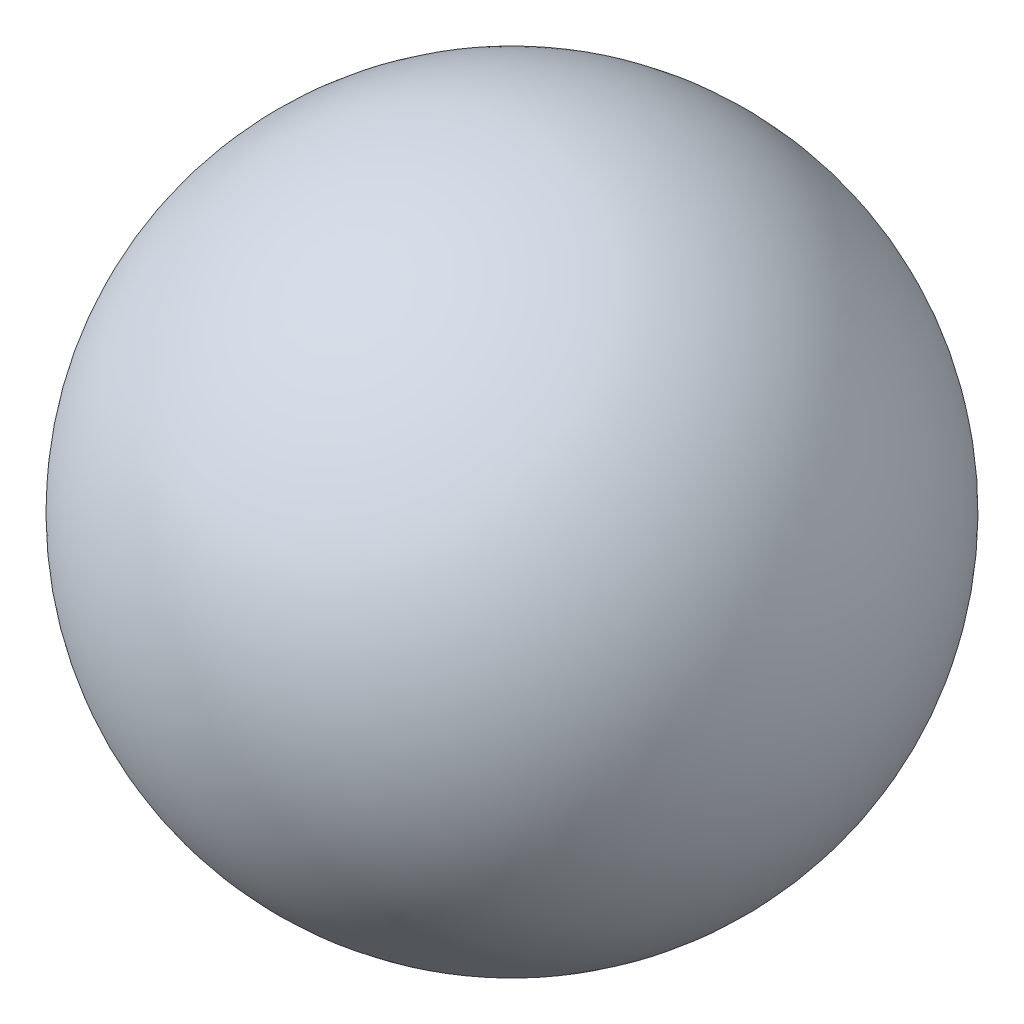
ISO-10303-21;
HEADER;
FILE_DESCRIPTION(('STEP AP214'),'2;1');
FILE_NAME('part.step','',(''),(''),'','','');
FILE_SCHEMA(('AUTOMOTIVE_DESIGN { 1 0 10303 214 1 1 1 1 }'));
ENDSEC;
DATA;
#1=APPLICATION_CONTEXT('core data for automotive mechanical design processes');
#2=APPLICATION_PROTOCOL_DEFINITION('international standard','automotive_design',2000,#1);
#3=PRODUCT_CONTEXT('',#1,'mechanical');
#4=PRODUCT('Part','Part','',(#3));
#5=PRODUCT_RELATED_PRODUCT_CATEGORY('part','',(#4));
#6=PRODUCT_DEFINITION_FORMATION('','',#4);
#7=PRODUCT_DEFINITION_CONTEXT('part definition',#1,'design');
#8=PRODUCT_DEFINITION('design','',#6,#7);
#9=PRODUCT_DEFINITION_SHAPE('','',#8);
#10=(LENGTH_UNIT() NAMED_UNIT(*) SI_UNIT(.MILLI.,.METRE.));
#11=(NAMED_UNIT(*) PLANE_ANGLE_UNIT() SI_UNIT($,.RADIAN.));
#12=(NAMED_UNIT(*) SI_UNIT($,.STERADIAN.) SOLID_ANGLE_UNIT());
#13=UNCERTAINTY_MEASURE_WITH_UNIT(LENGTH_MEASURE(1.E-05),#10,'distance_accuracy_value','');
#14=(GEOMETRIC_REPRESENTATION_CONTEXT(3) GLOBAL_UNCERTAINTY_ASSIGNED_CONTEXT((#13)) GLOBAL_UNIT_ASSIGNED_CONTEXT((#10,
#11,#12)) REPRESENTATION_CONTEXT('',''));
#15=CARTESIAN_POINT('',(0.,0.,0.));
#16=DIRECTION('',(0.,0.,1.));
#17=DIRECTION('',(1.,0.,0.));
#18=AXIS2_PLACEMENT_3D('',#15,#16,#17);
#19=CARTESIAN_POINT('',(64.16,-69.2599354328162,4.1306213627161));
#20=DIRECTION('',(0.,-0.998226300863558,0.0595336229727175));
#21=DIRECTION('',(0.173648177666934,-0.0586291734684379,-0.983061000351128));
#22=AXIS2_PLACEMENT_3D('',#19,#20,#21);
#23=SPHERICAL_SURFACE('',#22,7.15);
#24=CARTESIAN_POINT('',(64.16,-62.1226173816418,3.70495595846117));
#25=VERTEX_POINT('',#24);
#26=VERTEX_LOOP('',#25);
#27=FACE_BOUND('',#26,.T.);
#28=CARTESIAN_POINT('',(64.16,-76.3972534839907,4.55628676697103));
#29=VERTEX_POINT('',#28);
#30=VERTEX_LOOP('',#29);
#31=FACE_BOUND('',#30,.T.);
#32=ADVANCED_FACE('F16',(#27,#31),#23,.T.);
#33=CLOSED_SHELL('',(#32));
#34=MANIFOLD_SOLID_BREP('B1',#33);
#35=ADVANCED_BREP_SHAPE_REPRESENTATION('',(#18,#34),#14);
#36=SHAPE_DEFINITION_REPRESENTATION(#9,#35);
ENDSEC;
END-ISO-10303-21;
